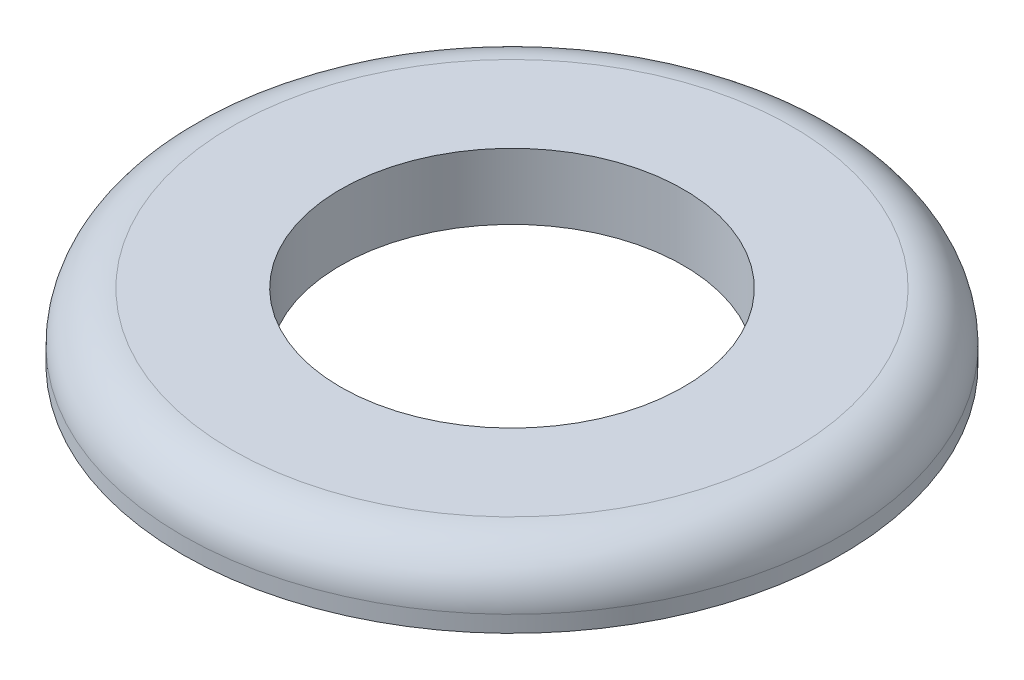
ISO-10303-21;
HEADER;
FILE_DESCRIPTION(('STEP AP214'),'2;1');
FILE_NAME('part.step','',(''),(''),'','','');
FILE_SCHEMA(('AUTOMOTIVE_DESIGN { 1 0 10303 214 1 1 1 1 }'));
ENDSEC;
DATA;
#1=APPLICATION_CONTEXT('core data for automotive mechanical design processes');
#2=APPLICATION_PROTOCOL_DEFINITION('international standard','automotive_design',2000,#1);
#3=PRODUCT_CONTEXT('',#1,'mechanical');
#4=PRODUCT('Part','Part','',(#3));
#5=PRODUCT_RELATED_PRODUCT_CATEGORY('part','',(#4));
#6=PRODUCT_DEFINITION_FORMATION('','',#4);
#7=PRODUCT_DEFINITION_CONTEXT('part definition',#1,'design');
#8=PRODUCT_DEFINITION('design','',#6,#7);
#9=PRODUCT_DEFINITION_SHAPE('','',#8);
#10=(LENGTH_UNIT() NAMED_UNIT(*) SI_UNIT(.MILLI.,.METRE.));
#11=(NAMED_UNIT(*) PLANE_ANGLE_UNIT() SI_UNIT($,.RADIAN.));
#12=(NAMED_UNIT(*) SI_UNIT($,.STERADIAN.) SOLID_ANGLE_UNIT());
#13=UNCERTAINTY_MEASURE_WITH_UNIT(LENGTH_MEASURE(1.E-05),#10,'distance_accuracy_value','');
#14=(GEOMETRIC_REPRESENTATION_CONTEXT(3) GLOBAL_UNCERTAINTY_ASSIGNED_CONTEXT((#13)) GLOBAL_UNIT_ASSIGNED_CONTEXT((#10,
#11,#12)) REPRESENTATION_CONTEXT('',''));
#15=CARTESIAN_POINT('',(0.,0.,0.));
#16=DIRECTION('',(0.,0.,1.));
#17=DIRECTION('',(1.,0.,0.));
#18=AXIS2_PLACEMENT_3D('',#15,#16,#17);
#19=CARTESIAN_POINT('',(0.,1.,0.));
#20=DIRECTION('',(0.,1.,0.));
#21=DIRECTION('',(0.,0.,1.));
#22=AXIS2_PLACEMENT_3D('',#19,#20,#21);
#23=PLANE('',#22);
#24=CARTESIAN_POINT('',(0.,1.,0.));
#25=DIRECTION('',(0.,1.,0.));
#26=DIRECTION('',(0.,0.,1.));
#27=AXIS2_PLACEMENT_3D('',#24,#25,#26);
#28=CIRCLE('',#27,4.25);
#29=CARTESIAN_POINT('',(0.,1.,4.25));
#30=VERTEX_POINT('',#29);
#31=EDGE_CURVE('E45',#30,#30,#28,.T.);
#32=ORIENTED_EDGE('',*,*,#31,.T.);
#33=EDGE_LOOP('',(#32));
#34=FACE_BOUND('',#33,.T.);
#35=CARTESIAN_POINT('',(0.,1.,0.));
#36=DIRECTION('',(0.,1.,0.));
#37=DIRECTION('',(0.,0.,1.));
#38=AXIS2_PLACEMENT_3D('',#35,#36,#37);
#39=CIRCLE('',#38,2.6);
#40=CARTESIAN_POINT('',(0.,1.,2.6));
#41=VERTEX_POINT('',#40);
#42=EDGE_CURVE('E55',#41,#41,#39,.T.);
#43=ORIENTED_EDGE('',*,*,#42,.F.);
#44=EDGE_LOOP('',(#43));
#45=FACE_BOUND('',#44,.T.);
#46=ADVANCED_FACE('F37',(#34,#45),#23,.T.);
#47=CARTESIAN_POINT('',(0.,0.,0.));
#48=DIRECTION('',(0.,1.,0.));
#49=DIRECTION('',(0.,0.,1.));
#50=AXIS2_PLACEMENT_3D('',#47,#48,#49);
#51=PLANE('',#50);
#52=CARTESIAN_POINT('',(0.,0.,0.));
#53=DIRECTION('',(0.,1.,0.));
#54=DIRECTION('',(0.,0.,1.));
#55=AXIS2_PLACEMENT_3D('',#52,#53,#54);
#56=CIRCLE('',#55,5.);
#57=CARTESIAN_POINT('',(0.,0.,5.));
#58=VERTEX_POINT('',#57);
#59=EDGE_CURVE('E50',#58,#58,#56,.T.);
#60=ORIENTED_EDGE('',*,*,#59,.F.);
#61=EDGE_LOOP('',(#60));
#62=FACE_BOUND('',#61,.T.);
#63=CARTESIAN_POINT('',(0.,0.,0.));
#64=DIRECTION('',(0.,1.,0.));
#65=DIRECTION('',(0.,0.,1.));
#66=AXIS2_PLACEMENT_3D('',#63,#64,#65);
#67=CIRCLE('',#66,2.6);
#68=CARTESIAN_POINT('',(0.,0.,2.6));
#69=VERTEX_POINT('',#68);
#70=EDGE_CURVE('E58',#69,#69,#67,.T.);
#71=ORIENTED_EDGE('',*,*,#70,.T.);
#72=EDGE_LOOP('',(#71));
#73=FACE_BOUND('',#72,.T.);
#74=ADVANCED_FACE('F70',(#62,#73),#51,.F.);
#75=CARTESIAN_POINT('',(0.,1.,0.));
#76=DIRECTION('',(0.,-1.,0.));
#77=DIRECTION('',(0.,0.,-1.));
#78=AXIS2_PLACEMENT_3D('',#75,#76,#77);
#79=CYLINDRICAL_SURFACE('',#78,5.);
#80=CARTESIAN_POINT('',(0.,0.25,0.));
#81=DIRECTION('',(0.,1.,0.));
#82=DIRECTION('',(0.,0.,1.));
#83=AXIS2_PLACEMENT_3D('',#80,#81,#82);
#84=CIRCLE('',#83,5.);
#85=CARTESIAN_POINT('',(0.,0.25,5.));
#86=VERTEX_POINT('',#85);
#87=EDGE_CURVE('E10',#86,#86,#84,.F.);
#88=ORIENTED_EDGE('',*,*,#87,.T.);
#89=EDGE_LOOP('',(#88));
#90=FACE_BOUND('',#89,.T.);
#91=ORIENTED_EDGE('',*,*,#59,.T.);
#92=EDGE_LOOP('',(#91));
#93=FACE_BOUND('',#92,.T.);
#94=ADVANCED_FACE('F75',(#90,#93),#79,.T.);
#95=CARTESIAN_POINT('',(0.,1.,0.));
#96=DIRECTION('',(0.,-1.,0.));
#97=DIRECTION('',(0.,0.,-1.));
#98=AXIS2_PLACEMENT_3D('',#95,#96,#97);
#99=CYLINDRICAL_SURFACE('',#98,2.6);
#100=ORIENTED_EDGE('',*,*,#42,.T.);
#101=EDGE_LOOP('',(#100));
#102=FACE_BOUND('',#101,.T.);
#103=ORIENTED_EDGE('',*,*,#70,.F.);
#104=EDGE_LOOP('',(#103));
#105=FACE_BOUND('',#104,.T.);
#106=ADVANCED_FACE('F66',(#102,#105),#99,.F.);
#107=CARTESIAN_POINT('',(0.,0.25,0.));
#108=DIRECTION('',(0.,1.,0.));
#109=DIRECTION('',(0.,0.,1.));
#110=AXIS2_PLACEMENT_3D('',#107,#108,#109);
#111=TOROIDAL_SURFACE('',#110,4.25,0.75);
#112=ORIENTED_EDGE('',*,*,#87,.F.);
#113=EDGE_LOOP('',(#112));
#114=FACE_BOUND('',#113,.T.);
#115=ORIENTED_EDGE('',*,*,#31,.F.);
#116=EDGE_LOOP('',(#115));
#117=FACE_BOUND('',#116,.T.);
#118=ADVANCED_FACE('F39',(#114,#117),#111,.T.);
#119=CLOSED_SHELL('',(#46,#74,#94,#106,#118));
#120=MANIFOLD_SOLID_BREP('B2',#119);
#121=ADVANCED_BREP_SHAPE_REPRESENTATION('',(#18,#120),#14);
#122=SHAPE_DEFINITION_REPRESENTATION(#9,#121);
ENDSEC;
END-ISO-10303-21;
